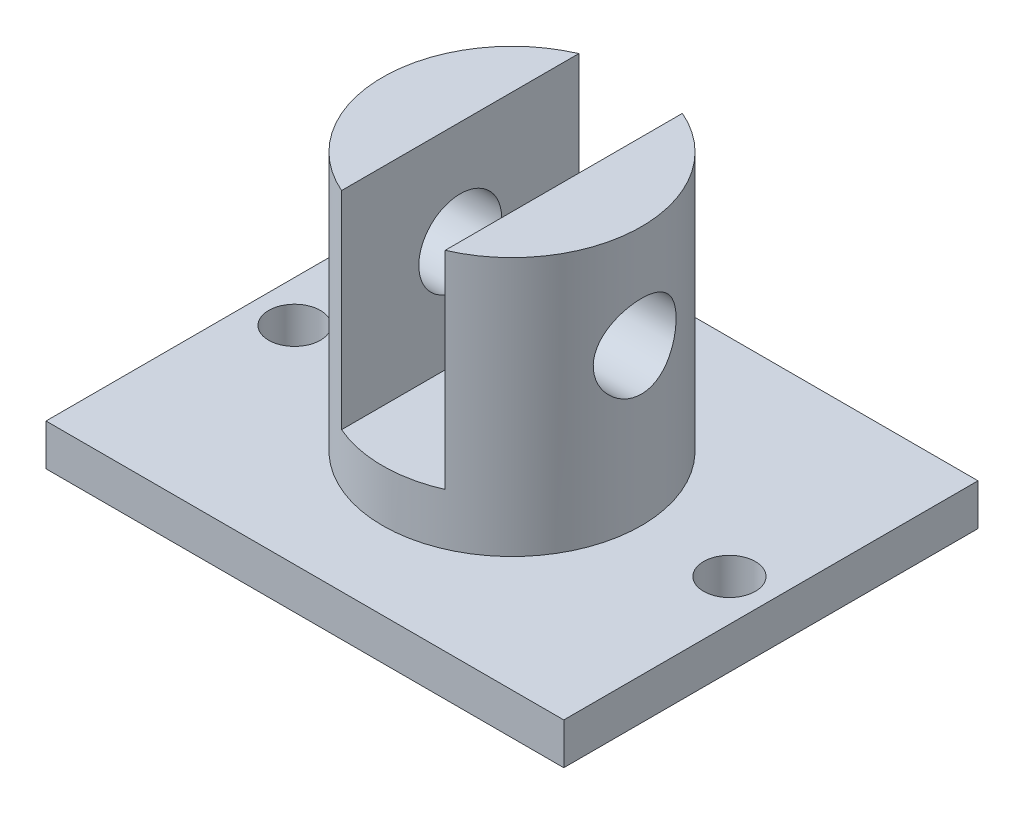
ISO-10303-21;
HEADER;
FILE_DESCRIPTION(('STEP AP214'),'2;1');
FILE_NAME('part.step','',(''),(''),'','','');
FILE_SCHEMA(('AUTOMOTIVE_DESIGN { 1 0 10303 214 1 1 1 1 }'));
ENDSEC;
DATA;
#1=APPLICATION_CONTEXT('core data for automotive mechanical design processes');
#2=APPLICATION_PROTOCOL_DEFINITION('international standard','automotive_design',2000,#1);
#3=PRODUCT_CONTEXT('',#1,'mechanical');
#4=PRODUCT('Part','Part','',(#3));
#5=PRODUCT_RELATED_PRODUCT_CATEGORY('part','',(#4));
#6=PRODUCT_DEFINITION_FORMATION('','',#4);
#7=PRODUCT_DEFINITION_CONTEXT('part definition',#1,'design');
#8=PRODUCT_DEFINITION('design','',#6,#7);
#9=PRODUCT_DEFINITION_SHAPE('','',#8);
#10=(LENGTH_UNIT() NAMED_UNIT(*) SI_UNIT(.MILLI.,.METRE.));
#11=(NAMED_UNIT(*) PLANE_ANGLE_UNIT() SI_UNIT($,.RADIAN.));
#12=(NAMED_UNIT(*) SI_UNIT($,.STERADIAN.) SOLID_ANGLE_UNIT());
#13=UNCERTAINTY_MEASURE_WITH_UNIT(LENGTH_MEASURE(1.E-05),#10,'distance_accuracy_value','');
#14=(GEOMETRIC_REPRESENTATION_CONTEXT(3) GLOBAL_UNCERTAINTY_ASSIGNED_CONTEXT((#13)) GLOBAL_UNIT_ASSIGNED_CONTEXT((#10,
#11,#12)) REPRESENTATION_CONTEXT('',''));
#15=CARTESIAN_POINT('',(0.,0.,0.));
#16=DIRECTION('',(0.,0.,1.));
#17=DIRECTION('',(1.,0.,0.));
#18=AXIS2_PLACEMENT_3D('',#15,#16,#17);
#19=CARTESIAN_POINT('',(0.,29.,0.));
#20=DIRECTION('',(0.,1.,0.));
#21=DIRECTION('',(0.,0.,1.));
#22=AXIS2_PLACEMENT_3D('',#19,#20,#21);
#23=PLANE('',#22);
#24=DIRECTION('',(0.,0.,-1.));
#25=VECTOR('',#24,1.);
#26=CARTESIAN_POINT('',(5.00000000000001,29.,0.));
#27=LINE('',#26,#25);
#28=CARTESIAN_POINT('',(5.00000000000001,29.,11.4564392373896));
#29=VERTEX_POINT('',#28);
#30=CARTESIAN_POINT('',(5.00000000000001,29.,-11.4564392373896));
#31=VERTEX_POINT('',#30);
#32=EDGE_CURVE('E120',#29,#31,#27,.T.);
#33=ORIENTED_EDGE('',*,*,#32,.F.);
#34=CARTESIAN_POINT('',(0.,29.,0.));
#35=DIRECTION('',(0.,1.,0.));
#36=DIRECTION('',(0.,0.,1.));
#37=AXIS2_PLACEMENT_3D('',#34,#35,#36);
#38=CIRCLE('',#37,12.5);
#39=EDGE_CURVE('E132',#29,#31,#38,.T.);
#40=ORIENTED_EDGE('',*,*,#39,.T.);
#41=EDGE_LOOP('',(#33,#40));
#42=FACE_BOUND('',#41,.T.);
#43=ADVANCED_FACE('F37',(#42),#23,.T.);
#44=CARTESIAN_POINT('',(25.,4.,-20.));
#45=DIRECTION('',(-1.,0.,0.));
#46=DIRECTION('',(0.,0.,1.));
#47=AXIS2_PLACEMENT_3D('',#44,#45,#46);
#48=PLANE('',#47);
#49=DIRECTION('',(0.,0.,-1.));
#50=VECTOR('',#49,1.);
#51=CARTESIAN_POINT('',(25.,0.,-20.));
#52=LINE('',#51,#50);
#53=CARTESIAN_POINT('',(25.,0.,20.));
#54=VERTEX_POINT('',#53);
#55=CARTESIAN_POINT('',(25.,0.,-20.));
#56=VERTEX_POINT('',#55);
#57=EDGE_CURVE('E136',#54,#56,#52,.T.);
#58=ORIENTED_EDGE('',*,*,#57,.T.);
#59=DIRECTION('',(0.,-1.,0.));
#60=VECTOR('',#59,1.);
#61=CARTESIAN_POINT('',(25.,4.,-20.));
#62=LINE('',#61,#60);
#63=CARTESIAN_POINT('',(25.,4.,-20.));
#64=VERTEX_POINT('',#63);
#65=EDGE_CURVE('E121',#64,#56,#62,.T.);
#66=ORIENTED_EDGE('',*,*,#65,.F.);
#67=DIRECTION('',(0.,0.,-1.));
#68=VECTOR('',#67,1.);
#69=CARTESIAN_POINT('',(25.,4.,-20.));
#70=LINE('',#69,#68);
#71=CARTESIAN_POINT('',(25.,4.,20.));
#72=VERTEX_POINT('',#71);
#73=EDGE_CURVE('E143',#72,#64,#70,.T.);
#74=ORIENTED_EDGE('',*,*,#73,.F.);
#75=DIRECTION('',(0.,-1.,0.));
#76=VECTOR('',#75,1.);
#77=CARTESIAN_POINT('',(25.,4.,20.));
#78=LINE('',#77,#76);
#79=EDGE_CURVE('E149',#72,#54,#78,.T.);
#80=ORIENTED_EDGE('',*,*,#79,.T.);
#81=EDGE_LOOP('',(#58,#66,#74,#80));
#82=FACE_BOUND('',#81,.T.);
#83=ADVANCED_FACE('F39',(#82),#48,.F.);
#84=CARTESIAN_POINT('',(-25.,4.,-20.));
#85=DIRECTION('',(0.,0.,1.));
#86=DIRECTION('',(1.,0.,0.));
#87=AXIS2_PLACEMENT_3D('',#84,#85,#86);
#88=PLANE('',#87);
#89=DIRECTION('',(-1.,0.,0.));
#90=VECTOR('',#89,1.);
#91=CARTESIAN_POINT('',(-25.,0.,-20.));
#92=LINE('',#91,#90);
#93=CARTESIAN_POINT('',(-25.,0.,-20.));
#94=VERTEX_POINT('',#93);
#95=EDGE_CURVE('E152',#56,#94,#92,.T.);
#96=ORIENTED_EDGE('',*,*,#95,.T.);
#97=DIRECTION('',(0.,-1.,0.));
#98=VECTOR('',#97,1.);
#99=CARTESIAN_POINT('',(-25.,4.,-20.));
#100=LINE('',#99,#98);
#101=CARTESIAN_POINT('',(-25.,4.,-20.));
#102=VERTEX_POINT('',#101);
#103=EDGE_CURVE('E160',#102,#94,#100,.T.);
#104=ORIENTED_EDGE('',*,*,#103,.F.);
#105=DIRECTION('',(-1.,0.,0.));
#106=VECTOR('',#105,1.);
#107=CARTESIAN_POINT('',(-25.,4.,-20.));
#108=LINE('',#107,#106);
#109=EDGE_CURVE('E92',#64,#102,#108,.T.);
#110=ORIENTED_EDGE('',*,*,#109,.F.);
#111=ORIENTED_EDGE('',*,*,#65,.T.);
#112=EDGE_LOOP('',(#96,#104,#110,#111));
#113=FACE_BOUND('',#112,.T.);
#114=ADVANCED_FACE('F228',(#113),#88,.F.);
#115=CARTESIAN_POINT('',(-25.,4.,-20.));
#116=DIRECTION('',(1.,0.,0.));
#117=DIRECTION('',(0.,0.,-1.));
#118=AXIS2_PLACEMENT_3D('',#115,#116,#117);
#119=PLANE('',#118);
#120=DIRECTION('',(0.,0.,1.));
#121=VECTOR('',#120,1.);
#122=CARTESIAN_POINT('',(-25.,0.,-20.));
#123=LINE('',#122,#121);
#124=CARTESIAN_POINT('',(-25.,0.,20.));
#125=VERTEX_POINT('',#124);
#126=EDGE_CURVE('E154',#94,#125,#123,.T.);
#127=ORIENTED_EDGE('',*,*,#126,.T.);
#128=DIRECTION('',(0.,-1.,0.));
#129=VECTOR('',#128,1.);
#130=CARTESIAN_POINT('',(-25.,4.,20.));
#131=LINE('',#130,#129);
#132=CARTESIAN_POINT('',(-25.,4.,20.));
#133=VERTEX_POINT('',#132);
#134=EDGE_CURVE('E158',#133,#125,#131,.T.);
#135=ORIENTED_EDGE('',*,*,#134,.F.);
#136=DIRECTION('',(0.,0.,1.));
#137=VECTOR('',#136,1.);
#138=CARTESIAN_POINT('',(-25.,4.,-20.));
#139=LINE('',#138,#137);
#140=EDGE_CURVE('E146',#102,#133,#139,.T.);
#141=ORIENTED_EDGE('',*,*,#140,.F.);
#142=ORIENTED_EDGE('',*,*,#103,.T.);
#143=EDGE_LOOP('',(#127,#135,#141,#142));
#144=FACE_BOUND('',#143,.T.);
#145=ADVANCED_FACE('F277',(#144),#119,.F.);
#146=CARTESIAN_POINT('',(-25.,4.,20.));
#147=DIRECTION('',(0.,0.,-1.));
#148=DIRECTION('',(-1.,0.,0.));
#149=AXIS2_PLACEMENT_3D('',#146,#147,#148);
#150=PLANE('',#149);
#151=DIRECTION('',(1.,0.,0.));
#152=VECTOR('',#151,1.);
#153=CARTESIAN_POINT('',(-25.,0.,20.));
#154=LINE('',#153,#152);
#155=EDGE_CURVE('E84',#125,#54,#154,.T.);
#156=ORIENTED_EDGE('',*,*,#155,.T.);
#157=ORIENTED_EDGE('',*,*,#79,.F.);
#158=DIRECTION('',(1.,0.,0.));
#159=VECTOR('',#158,1.);
#160=CARTESIAN_POINT('',(-25.,4.,20.));
#161=LINE('',#160,#159);
#162=EDGE_CURVE('E63',#133,#72,#161,.T.);
#163=ORIENTED_EDGE('',*,*,#162,.F.);
#164=ORIENTED_EDGE('',*,*,#134,.T.);
#165=EDGE_LOOP('',(#156,#157,#163,#164));
#166=FACE_BOUND('',#165,.T.);
#167=ADVANCED_FACE('F273',(#166),#150,.F.);
#168=CARTESIAN_POINT('',(0.,4.,0.));
#169=DIRECTION('',(0.,1.,0.));
#170=DIRECTION('',(0.,0.,1.));
#171=AXIS2_PLACEMENT_3D('',#168,#169,#170);
#172=PLANE('',#171);
#173=CARTESIAN_POINT('',(21.,4.,0.));
#174=DIRECTION('',(0.,1.,0.));
#175=DIRECTION('',(0.,0.,1.));
#176=AXIS2_PLACEMENT_3D('',#173,#174,#175);
#177=CIRCLE('',#176,2.5);
#178=CARTESIAN_POINT('',(21.,4.,2.5));
#179=VERTEX_POINT('',#178);
#180=EDGE_CURVE('E178',#179,#179,#177,.T.);
#181=ORIENTED_EDGE('',*,*,#180,.F.);
#182=EDGE_LOOP('',(#181));
#183=FACE_BOUND('',#182,.T.);
#184=CARTESIAN_POINT('',(-21.,4.,0.));
#185=DIRECTION('',(0.,1.,0.));
#186=DIRECTION('',(0.,0.,1.));
#187=AXIS2_PLACEMENT_3D('',#184,#185,#186);
#188=CIRCLE('',#187,2.5);
#189=CARTESIAN_POINT('',(-21.,4.,2.5));
#190=VERTEX_POINT('',#189);
#191=EDGE_CURVE('E170',#190,#190,#188,.T.);
#192=ORIENTED_EDGE('',*,*,#191,.F.);
#193=EDGE_LOOP('',(#192));
#194=FACE_BOUND('',#193,.T.);
#195=CARTESIAN_POINT('',(0.,4.,0.));
#196=DIRECTION('',(0.,1.,0.));
#197=DIRECTION('',(0.,0.,1.));
#198=AXIS2_PLACEMENT_3D('',#195,#196,#197);
#199=CIRCLE('',#198,12.5);
#200=CARTESIAN_POINT('',(0.,4.,12.5));
#201=VERTEX_POINT('',#200);
#202=EDGE_CURVE('E133',#201,#201,#199,.T.);
#203=ORIENTED_EDGE('',*,*,#202,.F.);
#204=EDGE_LOOP('',(#203));
#205=FACE_BOUND('',#204,.T.);
#206=ORIENTED_EDGE('',*,*,#73,.T.);
#207=ORIENTED_EDGE('',*,*,#109,.T.);
#208=ORIENTED_EDGE('',*,*,#140,.T.);
#209=ORIENTED_EDGE('',*,*,#162,.T.);
#210=EDGE_LOOP('',(#206,#207,#208,#209));
#211=FACE_BOUND('',#210,.T.);
#212=ADVANCED_FACE('F266',(#183,#194,#205,#211),#172,.T.);
#213=CARTESIAN_POINT('',(0.,0.,0.));
#214=DIRECTION('',(0.,1.,0.));
#215=DIRECTION('',(0.,0.,1.));
#216=AXIS2_PLACEMENT_3D('',#213,#214,#215);
#217=PLANE('',#216);
#218=CARTESIAN_POINT('',(21.,0.,0.));
#219=DIRECTION('',(0.,1.,0.));
#220=DIRECTION('',(0.,0.,1.));
#221=AXIS2_PLACEMENT_3D('',#218,#219,#220);
#222=CIRCLE('',#221,2.5);
#223=CARTESIAN_POINT('',(21.,0.,2.5));
#224=VERTEX_POINT('',#223);
#225=EDGE_CURVE('E41',#224,#224,#222,.T.);
#226=ORIENTED_EDGE('',*,*,#225,.T.);
#227=EDGE_LOOP('',(#226));
#228=FACE_BOUND('',#227,.T.);
#229=CARTESIAN_POINT('',(-21.,0.,0.));
#230=DIRECTION('',(0.,1.,0.));
#231=DIRECTION('',(0.,0.,1.));
#232=AXIS2_PLACEMENT_3D('',#229,#230,#231);
#233=CIRCLE('',#232,2.5);
#234=CARTESIAN_POINT('',(-21.,0.,2.5));
#235=VERTEX_POINT('',#234);
#236=EDGE_CURVE('E168',#235,#235,#233,.T.);
#237=ORIENTED_EDGE('',*,*,#236,.T.);
#238=EDGE_LOOP('',(#237));
#239=FACE_BOUND('',#238,.T.);
#240=ORIENTED_EDGE('',*,*,#57,.F.);
#241=ORIENTED_EDGE('',*,*,#155,.F.);
#242=ORIENTED_EDGE('',*,*,#126,.F.);
#243=ORIENTED_EDGE('',*,*,#95,.F.);
#244=EDGE_LOOP('',(#240,#241,#242,#243));
#245=FACE_BOUND('',#244,.T.);
#246=ADVANCED_FACE('F221',(#228,#239,#245),#217,.F.);
#247=CARTESIAN_POINT('',(0.,29.,0.));
#248=DIRECTION('',(0.,-1.,0.));
#249=DIRECTION('',(0.,0.,-1.));
#250=AXIS2_PLACEMENT_3D('',#247,#248,#249);
#251=CYLINDRICAL_SURFACE('',#250,12.5);
#252=CARTESIAN_POINT('',(-11.842719282327,19.,-4.));
#253=CARTESIAN_POINT('',(-11.8427199699566,19.2184155949729,-3.99999935935302));
#254=CARTESIAN_POINT('',(-11.8488277399487,19.4368387593864,-3.98204982916322));
#255=CARTESIAN_POINT('',(-11.8724842974625,19.8672489690504,-3.91094422931103));
#256=CARTESIAN_POINT('',(-11.8900357393061,20.0792345091736,-3.85777999166795));
#257=CARTESIAN_POINT('',(-11.9343925365716,20.4904702541019,-3.71827554706383));
#258=CARTESIAN_POINT('',(-11.9611808918508,20.6897430632552,-3.63199625417291));
#259=CARTESIAN_POINT('',(-12.0209691387475,21.0710441025551,-3.42891586136008));
#260=CARTESIAN_POINT('',(-12.0539702268166,21.2530690009217,-3.3121088807135));
#261=CARTESIAN_POINT('',(-12.1237992191192,21.6012659878293,-3.04678104882872));
#262=CARTESIAN_POINT('',(-12.1607169507637,21.7667254136869,-2.89734836823298));
#263=CARTESIAN_POINT('',(-12.2334570053411,22.0707160646597,-2.57296030582542));
#264=CARTESIAN_POINT('',(-12.269279166812,22.2092433365555,-2.39800118371827));
#265=CARTESIAN_POINT('',(-12.3368238271391,22.45861346325,-2.02237355615693));
#266=CARTESIAN_POINT('',(-12.3684282786178,22.5687178732731,-1.82119171965248));
#267=CARTESIAN_POINT('',(-12.4229242661366,22.7532464099141,-1.40198048377137));
#268=CARTESIAN_POINT('',(-12.4458179551613,22.8276793544067,-1.18395526351671));
#269=CARTESIAN_POINT('',(-12.479676950379,22.9363594480709,-0.744711775297693));
#270=CARTESIAN_POINT('',(-12.4910032748545,22.971825644154,-0.523823472185483));
#271=CARTESIAN_POINT('',(-12.5017287029849,23.0054327637528,-0.0789603248012289));
#272=CARTESIAN_POINT('',(-12.5011306457409,23.0035825720045,0.145013772077128));
#273=CARTESIAN_POINT('',(-12.4883236997896,22.9634012450691,0.581093729167384));
#274=CARTESIAN_POINT('',(-12.4765357034484,22.9263925053985,0.79333579075878));
#275=CARTESIAN_POINT('',(-12.4431948493389,22.8191204418971,1.20842073412411));
#276=CARTESIAN_POINT('',(-12.4216413449197,22.7488549158599,1.41126299248278));
#277=CARTESIAN_POINT('',(-12.3706365500491,22.5762419187057,1.80478487403707));
#278=CARTESIAN_POINT('',(-12.3410893332516,22.473502046017,1.99527942968321));
#279=CARTESIAN_POINT('',(-12.2771970855205,22.2391744827527,2.35672859352838));
#280=CARTESIAN_POINT('',(-12.2428507979634,22.1075792313199,2.52767806251326));
#281=CARTESIAN_POINT('',(-12.1712367294856,21.8125308956707,2.8530638131067));
#282=CARTESIAN_POINT('',(-12.1339068619231,21.6479390923703,3.00645534449559));
#283=CARTESIAN_POINT('',(-12.0618145989439,21.2950293475369,3.28378018395939));
#284=CARTESIAN_POINT('',(-12.0270525377475,21.1067083260587,3.40770966195435));
#285=CARTESIAN_POINT('',(-11.9637089339779,20.7086081493091,3.62388810953954));
#286=CARTESIAN_POINT('',(-11.9352081440021,20.498594811739,3.71573126088371));
#287=CARTESIAN_POINT('',(-11.8885562852076,20.0649479842031,3.8624115437165));
#288=CARTESIAN_POINT('',(-11.8704012824717,19.8413197070774,3.91726274260851));
#289=CARTESIAN_POINT('',(-11.8473757948988,19.3968402247348,3.98634732980607));
#290=CARTESIAN_POINT('',(-11.8419801089925,19.1762658791782,4.0021876938619));
#291=CARTESIAN_POINT('',(-11.8436224693089,18.7355893236636,3.99732669767184));
#292=CARTESIAN_POINT('',(-11.8506584784444,18.515487042269,3.97663132425953));
#293=CARTESIAN_POINT('',(-11.8758511036107,18.0890574316382,3.90072533361949));
#294=CARTESIAN_POINT('',(-11.8936586123319,17.8825146332527,3.84659716428486));
#295=CARTESIAN_POINT('',(-11.9380128770361,17.4814721006504,3.70664280725108));
#296=CARTESIAN_POINT('',(-11.9645611032884,17.2869743990738,3.62081128645948));
#297=CARTESIAN_POINT('',(-12.0243860591649,16.9091303820954,3.41697396012587));
#298=CARTESIAN_POINT('',(-12.0578396098649,16.7262886029767,3.29808617389175));
#299=CARTESIAN_POINT('',(-12.1273479833206,16.3825664445406,3.03252999413197));
#300=CARTESIAN_POINT('',(-12.1634035126375,16.2216920649792,2.88585403708636));
#301=CARTESIAN_POINT('',(-12.2359628130699,15.9192022234145,2.56125244512296));
#302=CARTESIAN_POINT('',(-12.2724171226716,15.7787379960407,2.38223997872511));
#303=CARTESIAN_POINT('',(-12.3400966382304,15.5297873068082,2.00229721221567));
#304=CARTESIAN_POINT('',(-12.3713220674134,15.4212994796963,1.80136784836229));
#305=CARTESIAN_POINT('',(-12.4248572290492,15.2404100068307,1.38445940226065));
#306=CARTESIAN_POINT('',(-12.4472294035216,15.1677547039656,1.16859881389167));
#307=CARTESIAN_POINT('',(-12.480810616577,15.0600397397232,0.726874957063006));
#308=CARTESIAN_POINT('',(-12.4920233359687,15.0249676816827,0.501015012458267));
#309=CARTESIAN_POINT('',(-12.5017663129826,14.9944607302506,0.0562765879062623));
#310=CARTESIAN_POINT('',(-12.5008274477244,14.9973667124253,-0.162477761236098));
#311=CARTESIAN_POINT('',(-12.4876568899275,15.0386927119456,-0.596238594775698));
#312=CARTESIAN_POINT('',(-12.4754259954572,15.0771102195009,-0.811245342941921));
#313=CARTESIAN_POINT('',(-12.4412233539435,15.1872956769149,-1.22850760398064));
#314=CARTESIAN_POINT('',(-12.4193869374855,15.2586009311141,-1.4308971714329));
#315=CARTESIAN_POINT('',(-12.3682230993078,15.4321165239307,-1.82093134276042));
#316=CARTESIAN_POINT('',(-12.3388943647058,15.5343322795866,-2.00857335487159));
#317=CARTESIAN_POINT('',(-12.2745138549376,15.7709027694635,-2.37094464163666));
#318=CARTESIAN_POINT('',(-12.2392975634481,15.906258090511,-2.54499113183174));
#319=CARTESIAN_POINT('',(-12.1675595998111,16.2035231896009,-2.86844801950664));
#320=CARTESIAN_POINT('',(-12.1310375306124,16.3654410992352,-3.01785084465771));
#321=CARTESIAN_POINT('',(-12.0592883124172,16.7180666140904,-3.29310491309765));
#322=CARTESIAN_POINT('',(-12.0241521106559,16.9095875051786,-3.41794102245578));
#323=CARTESIAN_POINT('',(-11.9607741956668,17.3119617641823,-3.63353471705189));
#324=CARTESIAN_POINT('',(-11.9325300332104,17.5228082276068,-3.72430441468119));
#325=CARTESIAN_POINT('',(-11.8881467072458,17.9424571027708,-3.86354015966022));
#326=CARTESIAN_POINT('',(-11.8712893448615,18.1503378897143,-3.91455627646292));
#327=CARTESIAN_POINT('',(-11.8485768271906,18.5721444970475,-3.98278180434112));
#328=CARTESIAN_POINT('',(-11.8427186088149,18.7860686176136,-4.00000062749409));
#329=CARTESIAN_POINT('',(-11.842719282327,19.,-4.));
#330=B_SPLINE_CURVE_WITH_KNOTS('',3,(#252,#253,#254,#255,#256,#257,#258,#259,#260,#261,#262,
#263,#264,#265,#266,#267,#268,#269,#270,#271,#272,#273,#274,#275,#276,#277,#278,#279,#280,#281,
#282,#283,#284,#285,#286,#287,#288,#289,#290,#291,#292,#293,#294,#295,#296,#297,#298,#299,#300,
#301,#302,#303,#304,#305,#306,#307,#308,#309,#310,#311,#312,#313,#314,#315,#316,#317,#318,#319,
#320,#321,#322,#323,#324,#325,#326,#327,#328,#329),.UNSPECIFIED.,.T.,.F.,(4,2,2,2,2,2,2,2,2,2,2,
2,2,2,2,2,2,2,2,2,2,2,2,2,2,2,2,2,2,2,2,2,2,2,2,2,2,2,4),(0.,0.654455842715349,1.309063538331,
1.96247283098348,2.6160080865338,3.29090543042416,3.96590176403352,4.65698443727681,
5.34789618881212,6.01651686048925,6.68497834076492,7.32925318507043,7.97357069810019,
8.62599225189614,9.27858496176539,9.95962670810641,10.6407569418194,11.3302140454822,
12.0194088123988,12.6796997833962,13.3398825675735,13.979736408686,14.6196979341528,
15.2787163323882,15.9379143638459,16.6259668097989,17.3139898746478,17.9970699222358,
18.6799245895442,19.3330513205858,19.9861318951797,20.6302921470087,21.2745653528473,
21.9414122843778,22.6084637396799,23.2990150253329,23.9893205507532,24.6305185843684,
25.2715380278761),.UNSPECIFIED.);
#331=CARTESIAN_POINT('',(-11.842719282327,19.,-4.));
#332=VERTEX_POINT('',#331);
#333=EDGE_CURVE('E190',#332,#332,#330,.T.);
#334=ORIENTED_EDGE('',*,*,#333,.T.);
#335=EDGE_LOOP('',(#334));
#336=FACE_BOUND('',#335,.T.);
#337=CARTESIAN_POINT('',(11.842719282327,19.,-4.));
#338=CARTESIAN_POINT('',(11.8427199699566,18.7815844050271,-3.99999935935302));
#339=CARTESIAN_POINT('',(11.8488277399487,18.5631612406136,-3.98204982916322));
#340=CARTESIAN_POINT('',(11.8724842974625,18.1327510309496,-3.91094422931103));
#341=CARTESIAN_POINT('',(11.8900357393061,17.9207654908265,-3.85777999166795));
#342=CARTESIAN_POINT('',(11.9343925365716,17.5095297458981,-3.71827554706383));
#343=CARTESIAN_POINT('',(11.9611808918508,17.3102569367448,-3.6319962541729));
#344=CARTESIAN_POINT('',(12.0209691387475,16.9289558974449,-3.42891586136007));
#345=CARTESIAN_POINT('',(12.0539702268166,16.7469309990783,-3.3121088807135));
#346=CARTESIAN_POINT('',(12.1237992191192,16.3987340121707,-3.04678104882872));
#347=CARTESIAN_POINT('',(12.1607169507637,16.2332745863131,-2.89734836823298));
#348=CARTESIAN_POINT('',(12.2334570053411,15.9292839353403,-2.57296030582542));
#349=CARTESIAN_POINT('',(12.269279166812,15.7907566634445,-2.39800118371827));
#350=CARTESIAN_POINT('',(12.3368238271391,15.54138653675,-2.02237355615693));
#351=CARTESIAN_POINT('',(12.3684282786178,15.4312821267269,-1.82119171965248));
#352=CARTESIAN_POINT('',(12.4229242661366,15.2467535900859,-1.40198048377137));
#353=CARTESIAN_POINT('',(12.4458179551613,15.1723206455933,-1.18395526351671));
#354=CARTESIAN_POINT('',(12.479676950379,15.0636405519291,-0.744711775297694));
#355=CARTESIAN_POINT('',(12.4910032748545,15.028174355846,-0.523823472185484));
#356=CARTESIAN_POINT('',(12.5017287029849,14.9945672362472,-0.0789603248012301));
#357=CARTESIAN_POINT('',(12.5011306457409,14.9964174279955,0.145013772077127));
#358=CARTESIAN_POINT('',(12.4883236997896,15.0365987549309,0.581093729167384));
#359=CARTESIAN_POINT('',(12.4765357034484,15.0736074946015,0.79333579075878));
#360=CARTESIAN_POINT('',(12.4431948493389,15.1808795581029,1.20842073412411));
#361=CARTESIAN_POINT('',(12.4216413449197,15.2511450841401,1.41126299248278));
#362=CARTESIAN_POINT('',(12.3706365500491,15.4237580812943,1.80478487403707));
#363=CARTESIAN_POINT('',(12.3410893332516,15.526497953983,1.99527942968321));
#364=CARTESIAN_POINT('',(12.2771970855205,15.7608255172473,2.35672859352838));
#365=CARTESIAN_POINT('',(12.2428507979634,15.8924207686801,2.52767806251326));
#366=CARTESIAN_POINT('',(12.1712367294856,16.1874691043293,2.8530638131067));
#367=CARTESIAN_POINT('',(12.1339068619231,16.3520609076297,3.00645534449559));
#368=CARTESIAN_POINT('',(12.0618145989439,16.7049706524631,3.28378018395939));
#369=CARTESIAN_POINT('',(12.0270525377475,16.8932916739413,3.40770966195435));
#370=CARTESIAN_POINT('',(11.9637089339779,17.2913918506909,3.62388810953954));
#371=CARTESIAN_POINT('',(11.9352081440021,17.501405188261,3.71573126088371));
#372=CARTESIAN_POINT('',(11.8885562852076,17.9350520157969,3.8624115437165));
#373=CARTESIAN_POINT('',(11.8704012824717,18.1586802929226,3.91726274260851));
#374=CARTESIAN_POINT('',(11.8473757948988,18.6031597752652,3.98634732980607));
#375=CARTESIAN_POINT('',(11.8419801089925,18.8237341208218,4.0021876938619));
#376=CARTESIAN_POINT('',(11.8436224693089,19.2644106763364,3.99732669767184));
#377=CARTESIAN_POINT('',(11.8506584784444,19.484512957731,3.97663132425953));
#378=CARTESIAN_POINT('',(11.8758511036107,19.9109425683618,3.90072533361949));
#379=CARTESIAN_POINT('',(11.8936586123319,20.1174853667473,3.84659716428486));
#380=CARTESIAN_POINT('',(11.9380128770361,20.5185278993496,3.70664280725108));
#381=CARTESIAN_POINT('',(11.9645611032884,20.7130256009262,3.62081128645948));
#382=CARTESIAN_POINT('',(12.0243860591649,21.0908696179046,3.41697396012587));
#383=CARTESIAN_POINT('',(12.0578396098649,21.2737113970233,3.29808617389175));
#384=CARTESIAN_POINT('',(12.1273479833206,21.6174335554594,3.03252999413196));
#385=CARTESIAN_POINT('',(12.1634035126375,21.7783079350208,2.88585403708636));
#386=CARTESIAN_POINT('',(12.2359628130699,22.0807977765855,2.56125244512296));
#387=CARTESIAN_POINT('',(12.2724171226716,22.2212620039593,2.38223997872511));
#388=CARTESIAN_POINT('',(12.3400966382304,22.4702126931918,2.00229721221567));
#389=CARTESIAN_POINT('',(12.3713220674134,22.5787005203037,1.80136784836229));
#390=CARTESIAN_POINT('',(12.4248572290492,22.7595899931693,1.38445940226065));
#391=CARTESIAN_POINT('',(12.4472294035216,22.8322452960344,1.16859881389167));
#392=CARTESIAN_POINT('',(12.480810616577,22.9399602602768,0.726874957063006));
#393=CARTESIAN_POINT('',(12.4920233359687,22.9750323183173,0.501015012458268));
#394=CARTESIAN_POINT('',(12.5017663129826,23.0055392697494,0.0562765879062625));
#395=CARTESIAN_POINT('',(12.5008274477244,23.0026332875747,-0.162477761236097));
#396=CARTESIAN_POINT('',(12.4876568899275,22.9613072880544,-0.596238594775698));
#397=CARTESIAN_POINT('',(12.4754259954572,22.9228897804991,-0.811245342941921));
#398=CARTESIAN_POINT('',(12.4412233539435,22.8127043230851,-1.22850760398064));
#399=CARTESIAN_POINT('',(12.4193869374855,22.7413990688859,-1.4308971714329));
#400=CARTESIAN_POINT('',(12.3682230993078,22.5678834760693,-1.82093134276042));
#401=CARTESIAN_POINT('',(12.3388943647058,22.4656677204134,-2.00857335487159));
#402=CARTESIAN_POINT('',(12.2745138549376,22.2290972305365,-2.37094464163666));
#403=CARTESIAN_POINT('',(12.2392975634481,22.093741909489,-2.54499113183174));
#404=CARTESIAN_POINT('',(12.1675595998111,21.7964768103991,-2.86844801950664));
#405=CARTESIAN_POINT('',(12.1310375306124,21.6345589007648,-3.01785084465771));
#406=CARTESIAN_POINT('',(12.0592883124172,21.2819333859096,-3.29310491309765));
#407=CARTESIAN_POINT('',(12.0241521106559,21.0904124948214,-3.41794102245578));
#408=CARTESIAN_POINT('',(11.9607741956668,20.6880382358177,-3.63353471705189));
#409=CARTESIAN_POINT('',(11.9325300332104,20.4771917723932,-3.72430441468119));
#410=CARTESIAN_POINT('',(11.8881467072458,20.0575428972292,-3.86354015966022));
#411=CARTESIAN_POINT('',(11.8712893448615,19.8496621102857,-3.91455627646292));
#412=CARTESIAN_POINT('',(11.8485768271906,19.4278555029525,-3.98278180434112));
#413=CARTESIAN_POINT('',(11.8427186088149,19.2139313823864,-4.00000062749409));
#414=CARTESIAN_POINT('',(11.842719282327,19.,-4.));
#415=B_SPLINE_CURVE_WITH_KNOTS('',3,(#337,#338,#339,#340,#341,#342,#343,#344,#345,#346,#347,
#348,#349,#350,#351,#352,#353,#354,#355,#356,#357,#358,#359,#360,#361,#362,#363,#364,#365,#366,
#367,#368,#369,#370,#371,#372,#373,#374,#375,#376,#377,#378,#379,#380,#381,#382,#383,#384,#385,
#386,#387,#388,#389,#390,#391,#392,#393,#394,#395,#396,#397,#398,#399,#400,#401,#402,#403,#404,
#405,#406,#407,#408,#409,#410,#411,#412,#413,#414),.UNSPECIFIED.,.T.,.F.,(4,2,2,2,2,2,2,2,2,2,2,
2,2,2,2,2,2,2,2,2,2,2,2,2,2,2,2,2,2,2,2,2,2,2,2,2,2,2,4),(0.,0.654455842715349,1.309063538331,
1.96247283098349,2.6160080865338,3.29090543042416,3.96590176403352,4.65698443727681,
5.34789618881212,6.01651686048925,6.68497834076492,7.32925318507043,7.97357069810019,
8.62599225189614,9.27858496176539,9.95962670810641,10.6407569418194,11.3302140454822,
12.0194088123988,12.6796997833962,13.3398825675735,13.979736408686,14.6196979341528,
15.2787163323882,15.9379143638459,16.6259668097989,17.3139898746478,17.9970699222358,
18.6799245895443,19.3330513205858,19.9861318951797,20.6302921470087,21.2745653528473,
21.9414122843778,22.6084637396799,23.2990150253329,23.9893205507533,24.6305185843684,
25.2715380278761),.UNSPECIFIED.);
#416=CARTESIAN_POINT('',(11.842719282327,19.,-4.));
#417=VERTEX_POINT('',#416);
#418=EDGE_CURVE('E183',#417,#417,#415,.T.);
#419=ORIENTED_EDGE('',*,*,#418,.T.);
#420=EDGE_LOOP('',(#419));
#421=FACE_BOUND('',#420,.T.);
#422=CARTESIAN_POINT('',(0.,9.,0.));
#423=DIRECTION('',(0.,-1.,0.));
#424=DIRECTION('',(0.,0.,-1.));
#425=AXIS2_PLACEMENT_3D('',#422,#423,#424);
#426=CIRCLE('',#425,12.5);
#427=CARTESIAN_POINT('',(-4.99999999999999,9.,-11.4564392373896));
#428=VERTEX_POINT('',#427);
#429=CARTESIAN_POINT('',(5.00000000000002,9.,-11.4564392373896));
#430=VERTEX_POINT('',#429);
#431=EDGE_CURVE('E11',#428,#430,#426,.T.);
#432=ORIENTED_EDGE('',*,*,#431,.T.);
#433=DIRECTION('',(0.,-1.,0.));
#434=VECTOR('',#433,1.);
#435=CARTESIAN_POINT('',(5.00000000000001,29.,-11.4564392373896));
#436=LINE('',#435,#434);
#437=EDGE_CURVE('E234',#430,#31,#436,.F.);
#438=ORIENTED_EDGE('',*,*,#437,.T.);
#439=ORIENTED_EDGE('',*,*,#39,.F.);
#440=DIRECTION('',(0.,-1.,0.));
#441=VECTOR('',#440,1.);
#442=CARTESIAN_POINT('',(5.00000000000001,29.,11.4564392373896));
#443=LINE('',#442,#441);
#444=CARTESIAN_POINT('',(5.00000000000002,9.,11.4564392373896));
#445=VERTEX_POINT('',#444);
#446=EDGE_CURVE('E138',#29,#445,#443,.T.);
#447=ORIENTED_EDGE('',*,*,#446,.T.);
#448=CARTESIAN_POINT('',(-4.99999999999999,9.,11.4564392373896));
#449=VERTEX_POINT('',#448);
#450=EDGE_CURVE('E46',#445,#449,#426,.T.);
#451=ORIENTED_EDGE('',*,*,#450,.T.);
#452=DIRECTION('',(0.,-1.,0.));
#453=VECTOR('',#452,1.);
#454=CARTESIAN_POINT('',(-4.99999999999999,29.,11.4564392373896));
#455=LINE('',#454,#453);
#456=CARTESIAN_POINT('',(-4.99999999999999,29.,11.4564392373896));
#457=VERTEX_POINT('',#456);
#458=EDGE_CURVE('E115',#449,#457,#455,.F.);
#459=ORIENTED_EDGE('',*,*,#458,.T.);
#460=CARTESIAN_POINT('',(-4.99999999999999,29.,-11.4564392373896));
#461=VERTEX_POINT('',#460);
#462=EDGE_CURVE('E127',#461,#457,#38,.T.);
#463=ORIENTED_EDGE('',*,*,#462,.F.);
#464=DIRECTION('',(0.,-1.,0.));
#465=VECTOR('',#464,1.);
#466=CARTESIAN_POINT('',(-4.99999999999999,29.,-11.4564392373896));
#467=LINE('',#466,#465);
#468=EDGE_CURVE('E54',#461,#428,#467,.T.);
#469=ORIENTED_EDGE('',*,*,#468,.T.);
#470=EDGE_LOOP('',(#432,#438,#439,#447,#451,#459,#463,#469));
#471=FACE_BOUND('',#470,.T.);
#472=ORIENTED_EDGE('',*,*,#202,.T.);
#473=EDGE_LOOP('',(#472));
#474=FACE_BOUND('',#473,.T.);
#475=ADVANCED_FACE('F125',(#336,#421,#471,#474),#251,.T.);
#476=DIRECTION('',(0.,0.,1.));
#477=VECTOR('',#476,1.);
#478=CARTESIAN_POINT('',(-4.99999999999999,29.,0.));
#479=LINE('',#478,#477);
#480=EDGE_CURVE('E112',#461,#457,#479,.T.);
#481=ORIENTED_EDGE('',*,*,#480,.F.);
#482=ORIENTED_EDGE('',*,*,#462,.T.);
#483=EDGE_LOOP('',(#481,#482));
#484=FACE_BOUND('',#483,.T.);
#485=ADVANCED_FACE('F131',(#484),#23,.T.);
#486=CARTESIAN_POINT('',(-4.99999999999999,9.,-20.));
#487=DIRECTION('',(0.,-1.,0.));
#488=DIRECTION('',(0.,0.,-1.));
#489=AXIS2_PLACEMENT_3D('',#486,#487,#488);
#490=PLANE('',#489);
#491=DIRECTION('',(0.,0.,1.));
#492=VECTOR('',#491,1.);
#493=CARTESIAN_POINT('',(5.00000000000002,9.,-20.));
#494=LINE('',#493,#492);
#495=EDGE_CURVE('E129',#430,#445,#494,.T.);
#496=ORIENTED_EDGE('',*,*,#495,.F.);
#497=ORIENTED_EDGE('',*,*,#431,.F.);
#498=DIRECTION('',(0.,0.,1.));
#499=VECTOR('',#498,1.);
#500=CARTESIAN_POINT('',(-4.99999999999999,9.,-20.));
#501=LINE('',#500,#499);
#502=EDGE_CURVE('E239',#428,#449,#501,.T.);
#503=ORIENTED_EDGE('',*,*,#502,.T.);
#504=ORIENTED_EDGE('',*,*,#450,.F.);
#505=EDGE_LOOP('',(#496,#497,#503,#504));
#506=FACE_BOUND('',#505,.T.);
#507=ADVANCED_FACE('F206',(#506),#490,.F.);
#508=CARTESIAN_POINT('',(5.00000000000001,29.,-20.));
#509=DIRECTION('',(1.,0.,0.));
#510=DIRECTION('',(0.,1.,0.));
#511=AXIS2_PLACEMENT_3D('',#508,#509,#510);
#512=PLANE('',#511);
#513=CARTESIAN_POINT('',(5.00000000000001,19.,0.));
#514=DIRECTION('',(1.,0.,0.));
#515=DIRECTION('',(0.,1.,0.));
#516=AXIS2_PLACEMENT_3D('',#513,#514,#515);
#517=CIRCLE('',#516,4.);
#518=CARTESIAN_POINT('',(5.00000000000001,23.,0.));
#519=VERTEX_POINT('',#518);
#520=EDGE_CURVE('E167',#519,#519,#517,.T.);
#521=ORIENTED_EDGE('',*,*,#520,.T.);
#522=EDGE_LOOP('',(#521));
#523=FACE_BOUND('',#522,.T.);
#524=ORIENTED_EDGE('',*,*,#32,.T.);
#525=ORIENTED_EDGE('',*,*,#437,.F.);
#526=ORIENTED_EDGE('',*,*,#495,.T.);
#527=ORIENTED_EDGE('',*,*,#446,.F.);
#528=EDGE_LOOP('',(#524,#525,#526,#527));
#529=FACE_BOUND('',#528,.T.);
#530=ADVANCED_FACE('F210',(#523,#529),#512,.F.);
#531=CARTESIAN_POINT('',(-4.99999999999999,29.,-20.));
#532=DIRECTION('',(-1.,0.,0.));
#533=DIRECTION('',(0.,-1.,0.));
#534=AXIS2_PLACEMENT_3D('',#531,#532,#533);
#535=PLANE('',#534);
#536=CARTESIAN_POINT('',(-4.99999999999999,19.,0.));
#537=DIRECTION('',(-1.,0.,0.));
#538=DIRECTION('',(0.,-1.,0.));
#539=AXIS2_PLACEMENT_3D('',#536,#537,#538);
#540=CIRCLE('',#539,4.);
#541=CARTESIAN_POINT('',(-4.99999999999999,15.,0.));
#542=VERTEX_POINT('',#541);
#543=EDGE_CURVE('E165',#542,#542,#540,.T.);
#544=ORIENTED_EDGE('',*,*,#543,.T.);
#545=EDGE_LOOP('',(#544));
#546=FACE_BOUND('',#545,.T.);
#547=ORIENTED_EDGE('',*,*,#480,.T.);
#548=ORIENTED_EDGE('',*,*,#458,.F.);
#549=ORIENTED_EDGE('',*,*,#502,.F.);
#550=ORIENTED_EDGE('',*,*,#468,.F.);
#551=EDGE_LOOP('',(#547,#548,#549,#550));
#552=FACE_BOUND('',#551,.T.);
#553=ADVANCED_FACE('F114',(#546,#552),#535,.F.);
#554=CARTESIAN_POINT('',(-25.,19.,0.));
#555=DIRECTION('',(1.,0.,0.));
#556=DIRECTION('',(0.,0.,-1.));
#557=AXIS2_PLACEMENT_3D('',#554,#555,#556);
#558=CYLINDRICAL_SURFACE('',#557,4.);
#559=ORIENTED_EDGE('',*,*,#543,.F.);
#560=EDGE_LOOP('',(#559));
#561=FACE_BOUND('',#560,.T.);
#562=ORIENTED_EDGE('',*,*,#333,.F.);
#563=EDGE_LOOP('',(#562));
#564=FACE_BOUND('',#563,.T.);
#565=ADVANCED_FACE('F197',(#561,#564),#558,.F.);
#566=ORIENTED_EDGE('',*,*,#520,.F.);
#567=EDGE_LOOP('',(#566));
#568=FACE_BOUND('',#567,.T.);
#569=ORIENTED_EDGE('',*,*,#418,.F.);
#570=EDGE_LOOP('',(#569));
#571=FACE_BOUND('',#570,.T.);
#572=ADVANCED_FACE('F202',(#568,#571),#558,.F.);
#573=CARTESIAN_POINT('',(-21.,-6.,0.));
#574=DIRECTION('',(0.,1.,0.));
#575=DIRECTION('',(0.,0.,1.));
#576=AXIS2_PLACEMENT_3D('',#573,#574,#575);
#577=CYLINDRICAL_SURFACE('',#576,2.5);
#578=ORIENTED_EDGE('',*,*,#191,.T.);
#579=EDGE_LOOP('',(#578));
#580=FACE_BOUND('',#579,.T.);
#581=ORIENTED_EDGE('',*,*,#236,.F.);
#582=EDGE_LOOP('',(#581));
#583=FACE_BOUND('',#582,.T.);
#584=ADVANCED_FACE('F204',(#580,#583),#577,.F.);
#585=CARTESIAN_POINT('',(21.,-6.,0.));
#586=DIRECTION('',(0.,1.,0.));
#587=DIRECTION('',(0.,0.,1.));
#588=AXIS2_PLACEMENT_3D('',#585,#586,#587);
#589=CYLINDRICAL_SURFACE('',#588,2.5);
#590=ORIENTED_EDGE('',*,*,#180,.T.);
#591=EDGE_LOOP('',(#590));
#592=FACE_BOUND('',#591,.T.);
#593=ORIENTED_EDGE('',*,*,#225,.F.);
#594=EDGE_LOOP('',(#593));
#595=FACE_BOUND('',#594,.T.);
#596=ADVANCED_FACE('F251',(#592,#595),#589,.F.);
#597=CLOSED_SHELL('',(#43,#83,#114,#145,#167,#212,#246,#475,#485,#507,#530,#553,#565,#572,#584,#596));
#598=MANIFOLD_SOLID_BREP('B2',#597);
#599=ADVANCED_BREP_SHAPE_REPRESENTATION('',(#18,#598),#14);
#600=SHAPE_DEFINITION_REPRESENTATION(#9,#599);
ENDSEC;
END-ISO-10303-21;
